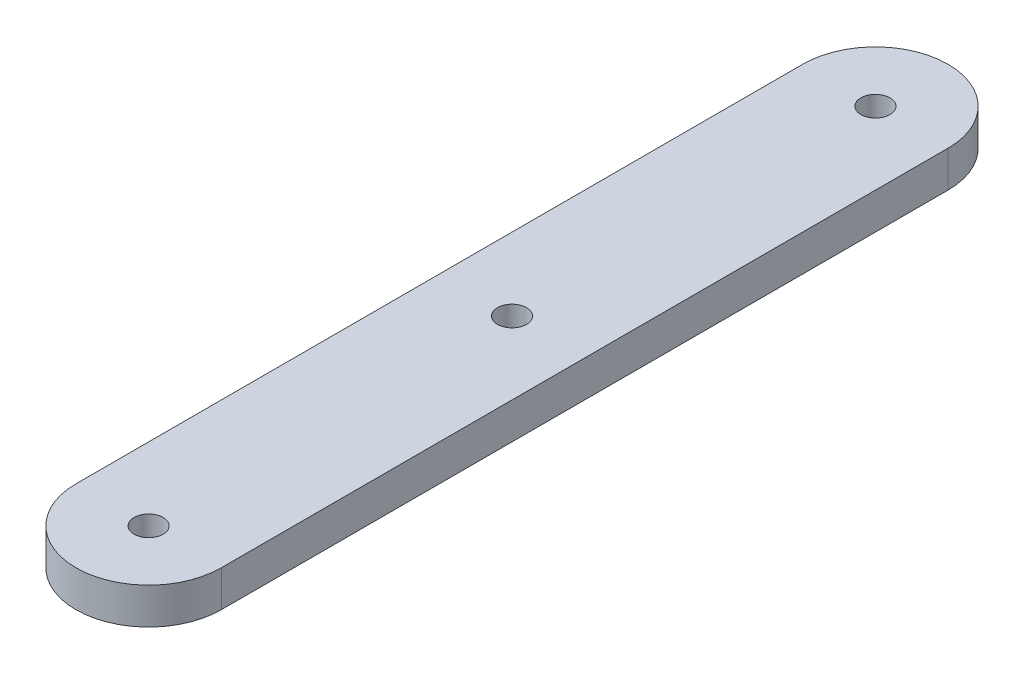
ISO-10303-21;
HEADER;
FILE_DESCRIPTION(('STEP AP214'),'2;1');
FILE_NAME('part.step','',(''),(''),'','','');
FILE_SCHEMA(('AUTOMOTIVE_DESIGN { 1 0 10303 214 1 1 1 1 }'));
ENDSEC;
DATA;
#1=APPLICATION_CONTEXT('core data for automotive mechanical design processes');
#2=APPLICATION_PROTOCOL_DEFINITION('international standard','automotive_design',2000,#1);
#3=PRODUCT_CONTEXT('',#1,'mechanical');
#4=PRODUCT('Part','Part','',(#3));
#5=PRODUCT_RELATED_PRODUCT_CATEGORY('part','',(#4));
#6=PRODUCT_DEFINITION_FORMATION('','',#4);
#7=PRODUCT_DEFINITION_CONTEXT('part definition',#1,'design');
#8=PRODUCT_DEFINITION('design','',#6,#7);
#9=PRODUCT_DEFINITION_SHAPE('','',#8);
#10=(LENGTH_UNIT() NAMED_UNIT(*) SI_UNIT(.MILLI.,.METRE.));
#11=(NAMED_UNIT(*) PLANE_ANGLE_UNIT() SI_UNIT($,.RADIAN.));
#12=(NAMED_UNIT(*) SI_UNIT($,.STERADIAN.) SOLID_ANGLE_UNIT());
#13=UNCERTAINTY_MEASURE_WITH_UNIT(LENGTH_MEASURE(1.E-05),#10,'distance_accuracy_value','');
#14=(GEOMETRIC_REPRESENTATION_CONTEXT(3) GLOBAL_UNCERTAINTY_ASSIGNED_CONTEXT((#13)) GLOBAL_UNIT_ASSIGNED_CONTEXT((#10,
#11,#12)) REPRESENTATION_CONTEXT('',''));
#15=CARTESIAN_POINT('',(0.,0.,0.));
#16=DIRECTION('',(0.,0.,1.));
#17=DIRECTION('',(1.,0.,0.));
#18=AXIS2_PLACEMENT_3D('',#15,#16,#17);
#19=CARTESIAN_POINT('',(0.,3.175,31.75));
#20=DIRECTION('',(0.,-1.,0.));
#21=DIRECTION('',(0.,0.,-1.));
#22=AXIS2_PLACEMENT_3D('',#19,#20,#21);
#23=CYLINDRICAL_SURFACE('',#22,6.35);
#24=CARTESIAN_POINT('',(0.,0.,31.75));
#25=DIRECTION('',(0.,1.,0.));
#26=DIRECTION('',(0.,0.,1.));
#27=AXIS2_PLACEMENT_3D('',#24,#25,#26);
#28=CIRCLE('',#27,6.35);
#29=CARTESIAN_POINT('',(6.35,0.,31.75));
#30=VERTEX_POINT('',#29);
#31=CARTESIAN_POINT('',(-6.35,0.,31.75));
#32=VERTEX_POINT('',#31);
#33=EDGE_CURVE('E107',#30,#32,#28,.F.);
#34=ORIENTED_EDGE('',*,*,#33,.F.);
#35=DIRECTION('',(0.,-1.,0.));
#36=VECTOR('',#35,1.);
#37=CARTESIAN_POINT('',(6.35,3.175,31.75));
#38=LINE('',#37,#36);
#39=CARTESIAN_POINT('',(6.35,3.175,31.75));
#40=VERTEX_POINT('',#39);
#41=EDGE_CURVE('E11',#40,#30,#38,.T.);
#42=ORIENTED_EDGE('',*,*,#41,.F.);
#43=CARTESIAN_POINT('',(0.,3.175,31.75));
#44=DIRECTION('',(0.,1.,0.));
#45=DIRECTION('',(0.,0.,1.));
#46=AXIS2_PLACEMENT_3D('',#43,#44,#45);
#47=CIRCLE('',#46,6.35);
#48=CARTESIAN_POINT('',(-6.35,3.175,31.75));
#49=VERTEX_POINT('',#48);
#50=EDGE_CURVE('E83',#40,#49,#47,.F.);
#51=ORIENTED_EDGE('',*,*,#50,.T.);
#52=DIRECTION('',(0.,-1.,0.));
#53=VECTOR('',#52,1.);
#54=CARTESIAN_POINT('',(-6.35,3.175,31.75));
#55=LINE('',#54,#53);
#56=EDGE_CURVE('E51',#49,#32,#55,.T.);
#57=ORIENTED_EDGE('',*,*,#56,.T.);
#58=EDGE_LOOP('',(#34,#42,#51,#57));
#59=FACE_BOUND('',#58,.T.);
#60=ADVANCED_FACE('F34',(#59),#23,.T.);
#61=CARTESIAN_POINT('',(6.35,3.175,0.));
#62=DIRECTION('',(-1.,0.,0.));
#63=DIRECTION('',(0.,0.,1.));
#64=AXIS2_PLACEMENT_3D('',#61,#62,#63);
#65=PLANE('',#64);
#66=DIRECTION('',(0.,0.,-1.));
#67=VECTOR('',#66,1.);
#68=CARTESIAN_POINT('',(6.35,0.,0.));
#69=LINE('',#68,#67);
#70=CARTESIAN_POINT('',(6.35,0.,-31.75));
#71=VERTEX_POINT('',#70);
#72=EDGE_CURVE('E89',#30,#71,#69,.T.);
#73=ORIENTED_EDGE('',*,*,#72,.T.);
#74=DIRECTION('',(0.,-1.,0.));
#75=VECTOR('',#74,1.);
#76=CARTESIAN_POINT('',(6.35,3.175,-31.75));
#77=LINE('',#76,#75);
#78=CARTESIAN_POINT('',(6.35,3.175,-31.75));
#79=VERTEX_POINT('',#78);
#80=EDGE_CURVE('E43',#79,#71,#77,.T.);
#81=ORIENTED_EDGE('',*,*,#80,.F.);
#82=DIRECTION('',(0.,0.,-1.));
#83=VECTOR('',#82,1.);
#84=CARTESIAN_POINT('',(6.35,3.175,0.));
#85=LINE('',#84,#83);
#86=EDGE_CURVE('E77',#40,#79,#85,.T.);
#87=ORIENTED_EDGE('',*,*,#86,.F.);
#88=ORIENTED_EDGE('',*,*,#41,.T.);
#89=EDGE_LOOP('',(#73,#81,#87,#88));
#90=FACE_BOUND('',#89,.T.);
#91=ADVANCED_FACE('F87',(#90),#65,.F.);
#92=CARTESIAN_POINT('',(0.,3.175,-31.75));
#93=DIRECTION('',(0.,-1.,0.));
#94=DIRECTION('',(0.,0.,-1.));
#95=AXIS2_PLACEMENT_3D('',#92,#93,#94);
#96=CYLINDRICAL_SURFACE('',#95,6.35);
#97=CARTESIAN_POINT('',(0.,0.,-31.75));
#98=DIRECTION('',(0.,1.,0.));
#99=DIRECTION('',(0.,0.,1.));
#100=AXIS2_PLACEMENT_3D('',#97,#98,#99);
#101=CIRCLE('',#100,6.35);
#102=CARTESIAN_POINT('',(-6.35,0.,-31.75));
#103=VERTEX_POINT('',#102);
#104=EDGE_CURVE('E110',#103,#71,#101,.F.);
#105=ORIENTED_EDGE('',*,*,#104,.F.);
#106=DIRECTION('',(0.,-1.,0.));
#107=VECTOR('',#106,1.);
#108=CARTESIAN_POINT('',(-6.35,3.175,-31.75));
#109=LINE('',#108,#107);
#110=CARTESIAN_POINT('',(-6.35,3.175,-31.75));
#111=VERTEX_POINT('',#110);
#112=EDGE_CURVE('E64',#111,#103,#109,.T.);
#113=ORIENTED_EDGE('',*,*,#112,.F.);
#114=CARTESIAN_POINT('',(0.,3.175,-31.75));
#115=DIRECTION('',(0.,1.,0.));
#116=DIRECTION('',(0.,0.,1.));
#117=AXIS2_PLACEMENT_3D('',#114,#115,#116);
#118=CIRCLE('',#117,6.35);
#119=EDGE_CURVE('E82',#111,#79,#118,.F.);
#120=ORIENTED_EDGE('',*,*,#119,.T.);
#121=ORIENTED_EDGE('',*,*,#80,.T.);
#122=EDGE_LOOP('',(#105,#113,#120,#121));
#123=FACE_BOUND('',#122,.T.);
#124=ADVANCED_FACE('F92',(#123),#96,.T.);
#125=CARTESIAN_POINT('',(0.,3.175,-31.75));
#126=DIRECTION('',(0.,-1.,0.));
#127=DIRECTION('',(0.,0.,-1.));
#128=AXIS2_PLACEMENT_3D('',#125,#126,#127);
#129=CYLINDRICAL_SURFACE('',#128,1.27);
#130=CARTESIAN_POINT('',(0.,3.175,-31.75));
#131=DIRECTION('',(0.,1.,0.));
#132=DIRECTION('',(0.,0.,1.));
#133=AXIS2_PLACEMENT_3D('',#130,#131,#132);
#134=CIRCLE('',#133,1.27);
#135=CARTESIAN_POINT('',(0.,3.175,-30.48));
#136=VERTEX_POINT('',#135);
#137=EDGE_CURVE('E124',#136,#136,#134,.T.);
#138=ORIENTED_EDGE('',*,*,#137,.T.);
#139=EDGE_LOOP('',(#138));
#140=FACE_BOUND('',#139,.T.);
#141=CARTESIAN_POINT('',(0.,0.,-31.75));
#142=DIRECTION('',(0.,1.,0.));
#143=DIRECTION('',(0.,0.,1.));
#144=AXIS2_PLACEMENT_3D('',#141,#142,#143);
#145=CIRCLE('',#144,1.27);
#146=CARTESIAN_POINT('',(0.,0.,-30.48));
#147=VERTEX_POINT('',#146);
#148=EDGE_CURVE('E104',#147,#147,#145,.T.);
#149=ORIENTED_EDGE('',*,*,#148,.F.);
#150=EDGE_LOOP('',(#149));
#151=FACE_BOUND('',#150,.T.);
#152=ADVANCED_FACE('F148',(#140,#151),#129,.F.);
#153=CARTESIAN_POINT('',(0.,3.175,31.75));
#154=DIRECTION('',(0.,-1.,0.));
#155=DIRECTION('',(0.,0.,-1.));
#156=AXIS2_PLACEMENT_3D('',#153,#154,#155);
#157=CYLINDRICAL_SURFACE('',#156,1.27);
#158=CARTESIAN_POINT('',(0.,3.175,31.75));
#159=DIRECTION('',(0.,1.,0.));
#160=DIRECTION('',(0.,0.,1.));
#161=AXIS2_PLACEMENT_3D('',#158,#159,#160);
#162=CIRCLE('',#161,1.27);
#163=CARTESIAN_POINT('',(0.,3.175,33.02));
#164=VERTEX_POINT('',#163);
#165=EDGE_CURVE('E119',#164,#164,#162,.T.);
#166=ORIENTED_EDGE('',*,*,#165,.T.);
#167=EDGE_LOOP('',(#166));
#168=FACE_BOUND('',#167,.T.);
#169=CARTESIAN_POINT('',(0.,0.,31.75));
#170=DIRECTION('',(0.,1.,0.));
#171=DIRECTION('',(0.,0.,1.));
#172=AXIS2_PLACEMENT_3D('',#169,#170,#171);
#173=CIRCLE('',#172,1.27);
#174=CARTESIAN_POINT('',(0.,0.,33.02));
#175=VERTEX_POINT('',#174);
#176=EDGE_CURVE('E101',#175,#175,#173,.T.);
#177=ORIENTED_EDGE('',*,*,#176,.F.);
#178=EDGE_LOOP('',(#177));
#179=FACE_BOUND('',#178,.T.);
#180=ADVANCED_FACE('F138',(#168,#179),#157,.F.);
#181=CARTESIAN_POINT('',(0.,3.175,0.));
#182=DIRECTION('',(0.,-1.,0.));
#183=DIRECTION('',(0.,0.,-1.));
#184=AXIS2_PLACEMENT_3D('',#181,#182,#183);
#185=CYLINDRICAL_SURFACE('',#184,1.27);
#186=CARTESIAN_POINT('',(0.,3.175,0.));
#187=DIRECTION('',(0.,1.,0.));
#188=DIRECTION('',(0.,0.,1.));
#189=AXIS2_PLACEMENT_3D('',#186,#187,#188);
#190=CIRCLE('',#189,1.27);
#191=CARTESIAN_POINT('',(0.,3.175,1.27));
#192=VERTEX_POINT('',#191);
#193=EDGE_CURVE('E115',#192,#192,#190,.T.);
#194=ORIENTED_EDGE('',*,*,#193,.T.);
#195=EDGE_LOOP('',(#194));
#196=FACE_BOUND('',#195,.T.);
#197=CARTESIAN_POINT('',(0.,0.,0.));
#198=DIRECTION('',(0.,1.,0.));
#199=DIRECTION('',(0.,0.,1.));
#200=AXIS2_PLACEMENT_3D('',#197,#198,#199);
#201=CIRCLE('',#200,1.27);
#202=CARTESIAN_POINT('',(0.,0.,1.27));
#203=VERTEX_POINT('',#202);
#204=EDGE_CURVE('E98',#203,#203,#201,.T.);
#205=ORIENTED_EDGE('',*,*,#204,.F.);
#206=EDGE_LOOP('',(#205));
#207=FACE_BOUND('',#206,.T.);
#208=ADVANCED_FACE('F36',(#196,#207),#185,.F.);
#209=CARTESIAN_POINT('',(-6.35,3.175,0.));
#210=DIRECTION('',(-1.,0.,0.));
#211=DIRECTION('',(0.,0.,1.));
#212=AXIS2_PLACEMENT_3D('',#209,#210,#211);
#213=PLANE('',#212);
#214=DIRECTION('',(0.,0.,-1.));
#215=VECTOR('',#214,1.);
#216=CARTESIAN_POINT('',(-6.35,0.,0.));
#217=LINE('',#216,#215);
#218=EDGE_CURVE('E112',#32,#103,#217,.T.);
#219=ORIENTED_EDGE('',*,*,#218,.F.);
#220=ORIENTED_EDGE('',*,*,#56,.F.);
#221=DIRECTION('',(0.,0.,-1.));
#222=VECTOR('',#221,1.);
#223=CARTESIAN_POINT('',(-6.35,3.175,0.));
#224=LINE('',#223,#222);
#225=EDGE_CURVE('E93',#49,#111,#224,.T.);
#226=ORIENTED_EDGE('',*,*,#225,.T.);
#227=ORIENTED_EDGE('',*,*,#112,.T.);
#228=EDGE_LOOP('',(#219,#220,#226,#227));
#229=FACE_BOUND('',#228,.T.);
#230=ADVANCED_FACE('F128',(#229),#213,.T.);
#231=CARTESIAN_POINT('',(0.,3.175,0.));
#232=DIRECTION('',(0.,1.,0.));
#233=DIRECTION('',(0.,0.,1.));
#234=AXIS2_PLACEMENT_3D('',#231,#232,#233);
#235=PLANE('',#234);
#236=ORIENTED_EDGE('',*,*,#193,.F.);
#237=EDGE_LOOP('',(#236));
#238=FACE_BOUND('',#237,.T.);
#239=ORIENTED_EDGE('',*,*,#165,.F.);
#240=EDGE_LOOP('',(#239));
#241=FACE_BOUND('',#240,.T.);
#242=ORIENTED_EDGE('',*,*,#137,.F.);
#243=EDGE_LOOP('',(#242));
#244=FACE_BOUND('',#243,.T.);
#245=ORIENTED_EDGE('',*,*,#50,.F.);
#246=ORIENTED_EDGE('',*,*,#86,.T.);
#247=ORIENTED_EDGE('',*,*,#119,.F.);
#248=ORIENTED_EDGE('',*,*,#225,.F.);
#249=EDGE_LOOP('',(#245,#246,#247,#248));
#250=FACE_BOUND('',#249,.T.);
#251=ADVANCED_FACE('F79',(#238,#241,#244,#250),#235,.T.);
#252=CARTESIAN_POINT('',(0.,0.,0.));
#253=DIRECTION('',(0.,1.,0.));
#254=DIRECTION('',(0.,0.,1.));
#255=AXIS2_PLACEMENT_3D('',#252,#253,#254);
#256=PLANE('',#255);
#257=ORIENTED_EDGE('',*,*,#204,.T.);
#258=EDGE_LOOP('',(#257));
#259=FACE_BOUND('',#258,.T.);
#260=ORIENTED_EDGE('',*,*,#176,.T.);
#261=EDGE_LOOP('',(#260));
#262=FACE_BOUND('',#261,.T.);
#263=ORIENTED_EDGE('',*,*,#148,.T.);
#264=EDGE_LOOP('',(#263));
#265=FACE_BOUND('',#264,.T.);
#266=ORIENTED_EDGE('',*,*,#33,.T.);
#267=ORIENTED_EDGE('',*,*,#218,.T.);
#268=ORIENTED_EDGE('',*,*,#104,.T.);
#269=ORIENTED_EDGE('',*,*,#72,.F.);
#270=EDGE_LOOP('',(#266,#267,#268,#269));
#271=FACE_BOUND('',#270,.T.);
#272=ADVANCED_FACE('F135',(#259,#262,#265,#271),#256,.F.);
#273=CLOSED_SHELL('',(#60,#91,#124,#152,#180,#208,#230,#251,#272));
#274=MANIFOLD_SOLID_BREP('B2',#273);
#275=ADVANCED_BREP_SHAPE_REPRESENTATION('',(#18,#274),#14);
#276=SHAPE_DEFINITION_REPRESENTATION(#9,#275);
ENDSEC;
END-ISO-10303-21;
